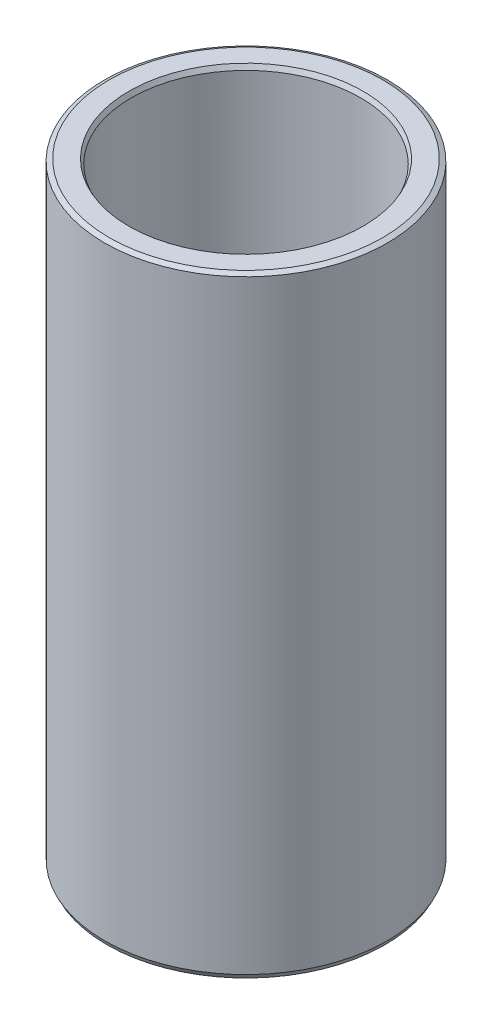
ISO-10303-21;
HEADER;
FILE_DESCRIPTION(('STEP AP214'),'2;1');
FILE_NAME('part.step','',(''),(''),'','','');
FILE_SCHEMA(('AUTOMOTIVE_DESIGN { 1 0 10303 214 1 1 1 1 }'));
ENDSEC;
DATA;
#1=APPLICATION_CONTEXT('core data for automotive mechanical design processes');
#2=APPLICATION_PROTOCOL_DEFINITION('international standard','automotive_design',2000,#1);
#3=PRODUCT_CONTEXT('',#1,'mechanical');
#4=PRODUCT('Part','Part','',(#3));
#5=PRODUCT_RELATED_PRODUCT_CATEGORY('part','',(#4));
#6=PRODUCT_DEFINITION_FORMATION('','',#4);
#7=PRODUCT_DEFINITION_CONTEXT('part definition',#1,'design');
#8=PRODUCT_DEFINITION('design','',#6,#7);
#9=PRODUCT_DEFINITION_SHAPE('','',#8);
#10=(LENGTH_UNIT() NAMED_UNIT(*) SI_UNIT(.MILLI.,.METRE.));
#11=(NAMED_UNIT(*) PLANE_ANGLE_UNIT() SI_UNIT($,.RADIAN.));
#12=(NAMED_UNIT(*) SI_UNIT($,.STERADIAN.) SOLID_ANGLE_UNIT());
#13=UNCERTAINTY_MEASURE_WITH_UNIT(LENGTH_MEASURE(1.E-05),#10,'distance_accuracy_value','');
#14=(GEOMETRIC_REPRESENTATION_CONTEXT(3) GLOBAL_UNCERTAINTY_ASSIGNED_CONTEXT((#13)) GLOBAL_UNIT_ASSIGNED_CONTEXT((#10,
#11,#12)) REPRESENTATION_CONTEXT('',''));
#15=CARTESIAN_POINT('',(0.,0.,0.));
#16=DIRECTION('',(0.,0.,1.));
#17=DIRECTION('',(1.,0.,0.));
#18=AXIS2_PLACEMENT_3D('',#15,#16,#17);
#19=CARTESIAN_POINT('',(0.,194.565541366562,0.));
#20=DIRECTION('',(0.,-1.,0.));
#21=DIRECTION('',(0.,0.,-1.));
#22=AXIS2_PLACEMENT_3D('',#19,#20,#21);
#23=CYLINDRICAL_SURFACE('',#22,45.);
#24=CARTESIAN_POINT('',(0.,1.47406431575203,0.));
#25=DIRECTION('',(0.,1.,0.));
#26=DIRECTION('',(0.,0.,1.));
#27=AXIS2_PLACEMENT_3D('',#24,#25,#26);
#28=CIRCLE('',#27,45.);
#29=CARTESIAN_POINT('',(0.,1.47406431575203,-45.));
#30=VERTEX_POINT('',#29);
#31=EDGE_CURVE('E10',#30,#30,#28,.T.);
#32=CARTESIAN_POINT('',(0.,193.831764609933,0.));
#33=DIRECTION('',(0.,1.,0.));
#34=DIRECTION('',(0.,0.,1.));
#35=AXIS2_PLACEMENT_3D('',#32,#33,#34);
#36=CIRCLE('',#35,45.);
#37=CARTESIAN_POINT('',(0.,193.831764609933,-45.));
#38=VERTEX_POINT('',#37);
#39=EDGE_CURVE('E50',#38,#38,#36,.F.);
#40=CARTESIAN_POINT('',(0.,1.47406431575203,-45.));
#41=CARTESIAN_POINT('',(0.,3.47779036048309,-45.));
#42=CARTESIAN_POINT('',(0.,5.48151640521414,-45.));
#43=CARTESIAN_POINT('',(0.,9.48896849467624,-45.));
#44=CARTESIAN_POINT('',(0.,11.4926945394073,-45.));
#45=CARTESIAN_POINT('',(0.,15.5001466288694,-45.));
#46=CARTESIAN_POINT('',(0.,17.5038726736004,-45.));
#47=CARTESIAN_POINT('',(0.,21.5113247630626,-45.));
#48=CARTESIAN_POINT('',(0.,23.5150508077936,-45.));
#49=CARTESIAN_POINT('',(0.,27.5225028972557,-45.));
#50=CARTESIAN_POINT('',(0.,29.5262289419867,-45.));
#51=CARTESIAN_POINT('',(0.,33.5336810314488,-45.));
#52=CARTESIAN_POINT('',(0.,35.5374070761799,-45.));
#53=CARTESIAN_POINT('',(0.,39.544859165642,-45.));
#54=CARTESIAN_POINT('',(0.,41.5485852103731,-45.));
#55=CARTESIAN_POINT('',(0.,45.5560372998352,-45.));
#56=CARTESIAN_POINT('',(0.,47.5597633445662,-45.));
#57=CARTESIAN_POINT('',(0.,51.5672154340283,-45.));
#58=CARTESIAN_POINT('',(0.,53.5709414787594,-45.));
#59=CARTESIAN_POINT('',(0.,57.5783935682215,-45.));
#60=CARTESIAN_POINT('',(0.,59.5821196129525,-45.));
#61=CARTESIAN_POINT('',(0.,63.5895717024146,-45.));
#62=CARTESIAN_POINT('',(0.,65.5932977471457,-45.));
#63=CARTESIAN_POINT('',(0.,69.6007498366078,-45.));
#64=CARTESIAN_POINT('',(0.,71.6044758813388,-45.));
#65=CARTESIAN_POINT('',(0.,75.6119279708009,-45.));
#66=CARTESIAN_POINT('',(0.,77.615654015532,-45.));
#67=CARTESIAN_POINT('',(0.,81.6231061049941,-45.));
#68=CARTESIAN_POINT('',(0.,83.6268321497251,-45.));
#69=CARTESIAN_POINT('',(0.,87.6342842391872,-45.));
#70=CARTESIAN_POINT('',(0.,89.6380102839183,-45.));
#71=CARTESIAN_POINT('',(0.,93.6454623733804,-45.));
#72=CARTESIAN_POINT('',(0.,95.6491884181115,-45.));
#73=CARTESIAN_POINT('',(0.,99.6566405075735,-45.));
#74=CARTESIAN_POINT('',(0.,101.660366552305,-45.));
#75=CARTESIAN_POINT('',(0.,105.667818641767,-45.));
#76=CARTESIAN_POINT('',(0.,107.671544686498,-45.));
#77=CARTESIAN_POINT('',(0.,111.67899677596,-45.));
#78=CARTESIAN_POINT('',(0.,113.682722820691,-45.));
#79=CARTESIAN_POINT('',(0.,117.690174910153,-45.));
#80=CARTESIAN_POINT('',(0.,119.693900954884,-45.));
#81=CARTESIAN_POINT('',(0.,123.701353044346,-45.));
#82=CARTESIAN_POINT('',(0.,125.705079089077,-45.));
#83=CARTESIAN_POINT('',(0.,129.712531178539,-45.));
#84=CARTESIAN_POINT('',(0.,131.71625722327,-45.));
#85=CARTESIAN_POINT('',(0.,135.723709312732,-45.));
#86=CARTESIAN_POINT('',(0.,137.727435357464,-45.));
#87=CARTESIAN_POINT('',(0.,141.734887446926,-45.));
#88=CARTESIAN_POINT('',(0.,143.738613491657,-45.));
#89=CARTESIAN_POINT('',(0.,147.746065581119,-45.));
#90=CARTESIAN_POINT('',(0.,149.74979162585,-45.));
#91=CARTESIAN_POINT('',(0.,153.757243715312,-45.));
#92=CARTESIAN_POINT('',(0.,155.760969760043,-45.));
#93=CARTESIAN_POINT('',(0.,159.768421849505,-45.));
#94=CARTESIAN_POINT('',(0.,161.772147894236,-45.));
#95=CARTESIAN_POINT('',(0.,165.779599983698,-45.));
#96=CARTESIAN_POINT('',(0.,167.783326028429,-45.));
#97=CARTESIAN_POINT('',(0.,171.790778117891,-45.));
#98=CARTESIAN_POINT('',(0.,173.794504162622,-45.));
#99=CARTESIAN_POINT('',(0.,177.801956252085,-45.));
#100=CARTESIAN_POINT('',(0.,179.805682296816,-45.));
#101=CARTESIAN_POINT('',(0.,183.813134386278,-45.));
#102=CARTESIAN_POINT('',(0.,185.816860431009,-45.));
#103=CARTESIAN_POINT('',(0.,189.824312520471,-45.));
#104=CARTESIAN_POINT('',(0.,191.828038565202,-45.));
#105=CARTESIAN_POINT('',(0.,193.831764609933,-45.));
#106=B_SPLINE_CURVE_WITH_KNOTS('',3,(#40,#41,#42,#43,#44,#45,#46,#47,#48,#49,#50,#51,#52,#53,
#54,#55,#56,#57,#58,#59,#60,#61,#62,#63,#64,#65,#66,#67,#68,#69,#70,#71,#72,#73,#74,#75,#76,#77,
#78,#79,#80,#81,#82,#83,#84,#85,#86,#87,#88,#89,#90,#91,#92,#93,#94,#95,#96,#97,#98,#99,#100,
#101,#102,#103,#104,#105),.UNSPECIFIED.,.F.,.F.,(4,2,2,2,2,2,2,2,2,2,2,2,2,2,2,2,2,2,2,2,2,2,2,
2,2,2,2,2,2,2,2,2,4),(0.,6.01117813419316,12.0223562683863,18.0335344025795,24.0447125367726,
30.0558906709658,36.0670688051589,42.0782469393521,48.0894250735452,54.1006032077384,
60.1117813419315,66.1229594761247,72.1341376103178,78.145315744511,84.1564938787042,
90.1676720128973,96.1788501470905,102.190028281284,108.201206415477,114.21238454967,
120.223562683863,126.234740818056,132.245918952249,138.257097086443,144.268275220636,
150.279453354829,156.290631489022,162.301809623215,168.312987757408,174.324165891601,
180.335344025795,186.346522159988,192.357700294181),.UNSPECIFIED.);
#107=EDGE_CURVE('BSEAM39',#30,#38,#106,.T.);
#108=ORIENTED_EDGE('',*,*,#31,.T.);
#109=ORIENTED_EDGE('',*,*,#39,.T.);
#110=ORIENTED_EDGE('',*,*,#107,.T.);
#111=ORIENTED_EDGE('',*,*,#107,.F.);
#112=EDGE_LOOP('',(#108,#110,#109,#111));
#113=FACE_BOUND('',#112,.T.);
#114=ADVANCED_FACE('F39',(#113),#23,.T.);
#115=CARTESIAN_POINT('',(0.,194.565541366562,0.));
#116=DIRECTION('',(0.,1.,0.));
#117=DIRECTION('',(0.,0.,1.));
#118=AXIS2_PLACEMENT_3D('',#115,#116,#117);
#119=PLANE('',#118);
#120=CARTESIAN_POINT('',(0.,194.565541366562,0.));
#121=DIRECTION('',(0.,1.,0.));
#122=DIRECTION('',(0.,0.,1.));
#123=AXIS2_PLACEMENT_3D('',#120,#121,#122);
#124=CIRCLE('',#123,37.2631580839012);
#125=CARTESIAN_POINT('',(0.,194.565541366562,37.2631580839012));
#126=VERTEX_POINT('',#125);
#127=EDGE_CURVE('E58',#126,#126,#124,.F.);
#128=ORIENTED_EDGE('',*,*,#127,.T.);
#129=EDGE_LOOP('',(#128));
#130=FACE_BOUND('',#129,.T.);
#131=CARTESIAN_POINT('',(0.,194.565541366562,0.));
#132=DIRECTION('',(0.,1.,0.));
#133=DIRECTION('',(0.,0.,1.));
#134=AXIS2_PLACEMENT_3D('',#131,#132,#133);
#135=CIRCLE('',#134,43.525935684248);
#136=CARTESIAN_POINT('',(0.,194.565541366562,-43.525935684248));
#137=VERTEX_POINT('',#136);
#138=EDGE_CURVE('E61',#137,#137,#135,.T.);
#139=ORIENTED_EDGE('',*,*,#138,.T.);
#140=EDGE_LOOP('',(#139));
#141=FACE_BOUND('',#140,.T.);
#142=ADVANCED_FACE('F88',(#130,#141),#119,.T.);
#143=CARTESIAN_POINT('',(0.,0.,0.));
#144=DIRECTION('',(0.,1.,0.));
#145=DIRECTION('',(0.,0.,1.));
#146=AXIS2_PLACEMENT_3D('',#143,#144,#145);
#147=PLANE('',#146);
#148=CARTESIAN_POINT('',(0.,0.,0.));
#149=DIRECTION('',(0.,1.,0.));
#150=DIRECTION('',(0.,0.,1.));
#151=AXIS2_PLACEMENT_3D('',#148,#149,#150);
#152=CIRCLE('',#151,38.003445643024);
#153=CARTESIAN_POINT('',(0.,0.,-38.003445643024));
#154=VERTEX_POINT('',#153);
#155=EDGE_CURVE('E51',#154,#154,#152,.T.);
#156=ORIENTED_EDGE('',*,*,#155,.T.);
#157=EDGE_LOOP('',(#156));
#158=FACE_BOUND('',#157,.T.);
#159=CARTESIAN_POINT('',(0.,0.,0.));
#160=DIRECTION('',(0.,1.,0.));
#161=DIRECTION('',(0.,0.,1.));
#162=AXIS2_PLACEMENT_3D('',#159,#160,#161);
#163=CIRCLE('',#162,44.2662232433708);
#164=CARTESIAN_POINT('',(0.,0.,44.2662232433708));
#165=VERTEX_POINT('',#164);
#166=EDGE_CURVE('E54',#165,#165,#163,.F.);
#167=ORIENTED_EDGE('',*,*,#166,.T.);
#168=EDGE_LOOP('',(#167));
#169=FACE_BOUND('',#168,.T.);
#170=ADVANCED_FACE('F83',(#158,#169),#147,.F.);
#171=CARTESIAN_POINT('',(0.,194.565541366562,0.));
#172=DIRECTION('',(0.,-1.,0.));
#173=DIRECTION('',(0.,0.,-1.));
#174=AXIS2_PLACEMENT_3D('',#171,#172,#173);
#175=CYLINDRICAL_SURFACE('',#174,36.529381327272);
#176=CARTESIAN_POINT('',(0.,193.09147705081,0.));
#177=DIRECTION('',(0.,1.,0.));
#178=DIRECTION('',(0.,0.,1.));
#179=AXIS2_PLACEMENT_3D('',#176,#177,#178);
#180=CIRCLE('',#179,36.529381327272);
#181=CARTESIAN_POINT('',(0.,193.09147705081,36.529381327272));
#182=VERTEX_POINT('',#181);
#183=EDGE_CURVE('E67',#182,#182,#180,.T.);
#184=ORIENTED_EDGE('',*,*,#183,.T.);
#185=EDGE_LOOP('',(#184));
#186=FACE_BOUND('',#185,.T.);
#187=CARTESIAN_POINT('',(0.,0.733776756629223,0.));
#188=DIRECTION('',(0.,1.,0.));
#189=DIRECTION('',(0.,0.,1.));
#190=AXIS2_PLACEMENT_3D('',#187,#188,#189);
#191=CIRCLE('',#190,36.529381327272);
#192=CARTESIAN_POINT('',(0.,0.733776756629223,-36.529381327272));
#193=VERTEX_POINT('',#192);
#194=EDGE_CURVE('E69',#193,#193,#191,.F.);
#195=ORIENTED_EDGE('',*,*,#194,.T.);
#196=EDGE_LOOP('',(#195));
#197=FACE_BOUND('',#196,.T.);
#198=ADVANCED_FACE('F71',(#186,#197),#175,.F.);
#199=CARTESIAN_POINT('',(0.,193.09147705081,0.));
#200=DIRECTION('',(0.,1.,0.));
#201=DIRECTION('',(0.,0.,1.));
#202=AXIS2_PLACEMENT_3D('',#199,#200,#201);
#203=CONICAL_SURFACE('',#202,36.529381327272,0.461879286618544);
#204=ORIENTED_EDGE('',*,*,#127,.F.);
#205=EDGE_LOOP('',(#204));
#206=FACE_BOUND('',#205,.T.);
#207=ORIENTED_EDGE('',*,*,#183,.F.);
#208=EDGE_LOOP('',(#207));
#209=FACE_BOUND('',#208,.T.);
#210=ADVANCED_FACE('F77',(#206,#209),#203,.F.);
#211=CARTESIAN_POINT('',(0.,0.,0.));
#212=DIRECTION('',(0.,-1.,0.));
#213=DIRECTION('',(0.,0.,-1.));
#214=AXIS2_PLACEMENT_3D('',#211,#212,#213);
#215=CONICAL_SURFACE('',#214,38.003445643024,1.10891704017636);
#216=CARTESIAN_POINT('',(0.,0.733776756629223,-36.529381327272));
#217=CARTESIAN_POINT('',(0.,0.726133248747668,-36.5447361638944));
#218=CARTESIAN_POINT('',(0.,0.718489740866114,-36.5600910005168));
#219=CARTESIAN_POINT('',(0.,0.703202725103005,-36.5908006737616));
#220=CARTESIAN_POINT('',(0.,0.695559217221451,-36.6061555103841));
#221=CARTESIAN_POINT('',(0.,0.680272201458342,-36.6368651836289));
#222=CARTESIAN_POINT('',(0.,0.672628693576788,-36.6522200202513));
#223=CARTESIAN_POINT('',(0.,0.657341677813679,-36.6829296934961));
#224=CARTESIAN_POINT('',(0.,0.649698169932124,-36.6982845301186));
#225=CARTESIAN_POINT('',(0.,0.634411154169016,-36.7289942033634));
#226=CARTESIAN_POINT('',(0.,0.626767646287461,-36.7443490399858));
#227=CARTESIAN_POINT('',(0.,0.611480630524352,-36.7750587132306));
#228=CARTESIAN_POINT('',(0.,0.603837122642798,-36.7904135498531));
#229=CARTESIAN_POINT('',(0.,0.588550106879689,-36.8211232230979));
#230=CARTESIAN_POINT('',(0.,0.580906598998135,-36.8364780597203));
#231=CARTESIAN_POINT('',(0.,0.565619583235026,-36.8671877329651));
#232=CARTESIAN_POINT('',(0.,0.557976075353471,-36.8825425695876));
#233=CARTESIAN_POINT('',(0.,0.542689059590362,-36.9132522428324));
#234=CARTESIAN_POINT('',(0.,0.535045551708809,-36.9286070794548));
#235=CARTESIAN_POINT('',(0.,0.5197585359457,-36.9593167526997));
#236=CARTESIAN_POINT('',(0.,0.512115028064145,-36.9746715893221));
#237=CARTESIAN_POINT('',(0.,0.496828012301036,-37.0053812625669));
#238=CARTESIAN_POINT('',(0.,0.489184504419482,-37.0207360991893));
#239=CARTESIAN_POINT('',(0.,0.473897488656373,-37.0514457724342));
#240=CARTESIAN_POINT('',(0.,0.466253980774819,-37.0668006090566));
#241=CARTESIAN_POINT('',(0.,0.45096696501171,-37.0975102823014));
#242=CARTESIAN_POINT('',(0.,0.443323457130156,-37.1128651189238));
#243=CARTESIAN_POINT('',(0.,0.428036441367047,-37.1435747921687));
#244=CARTESIAN_POINT('',(0.,0.420392933485492,-37.1589296287911));
#245=CARTESIAN_POINT('',(0.,0.405105917722384,-37.1896393020359));
#246=CARTESIAN_POINT('',(0.,0.397462409840829,-37.2049941386583));
#247=CARTESIAN_POINT('',(0.,0.38217539407772,-37.2357038119032));
#248=CARTESIAN_POINT('',(0.,0.374531886196166,-37.2510586485256));
#249=CARTESIAN_POINT('',(0.,0.359244870433057,-37.2817683217704));
#250=CARTESIAN_POINT('',(0.,0.351601362551503,-37.2971231583928));
#251=CARTESIAN_POINT('',(0.,0.336314346788394,-37.3278328316377));
#252=CARTESIAN_POINT('',(0.,0.328670838906839,-37.3431876682601));
#253=CARTESIAN_POINT('',(0.,0.313383823143731,-37.3738973415049));
#254=CARTESIAN_POINT('',(0.,0.305740315262176,-37.3892521781273));
#255=CARTESIAN_POINT('',(0.,0.290453299499067,-37.4199618513722));
#256=CARTESIAN_POINT('',(0.,0.282809791617513,-37.4353166879946));
#257=CARTESIAN_POINT('',(0.,0.267522775854404,-37.4660263612394));
#258=CARTESIAN_POINT('',(0.,0.25987926797285,-37.4813811978618));
#259=CARTESIAN_POINT('',(0.,0.244592252209741,-37.5120908711067));
#260=CARTESIAN_POINT('',(0.,0.236948744328187,-37.5274457077291));
#261=CARTESIAN_POINT('',(0.,0.221661728565078,-37.5581553809739));
#262=CARTESIAN_POINT('',(0.,0.214018220683523,-37.5735102175963));
#263=CARTESIAN_POINT('',(0.,0.198731204920414,-37.6042198908412));
#264=CARTESIAN_POINT('',(0.,0.19108769703886,-37.6195747274636));
#265=CARTESIAN_POINT('',(0.,0.175800681275752,-37.6502844007084));
#266=CARTESIAN_POINT('',(0.,0.168157173394197,-37.6656392373308));
#267=CARTESIAN_POINT('',(0.,0.152870157631088,-37.6963489105757));
#268=CARTESIAN_POINT('',(0.,0.145226649749534,-37.7117037471981));
#269=CARTESIAN_POINT('',(0.,0.129939633986425,-37.7424134204429));
#270=CARTESIAN_POINT('',(0.,0.122296126104871,-37.7577682570653));
#271=CARTESIAN_POINT('',(0.,0.107009110341762,-37.7884779303102));
#272=CARTESIAN_POINT('',(0.,0.0993656024602073,-37.8038327669326));
#273=CARTESIAN_POINT('',(0.,0.0840785866970985,-37.8345424401774));
#274=CARTESIAN_POINT('',(0.,0.0764350788155441,-37.8498972767998));
#275=CARTESIAN_POINT('',(0.,0.0611480630524352,-37.8806069500447));
#276=CARTESIAN_POINT('',(0.,0.0535045551708808,-37.8959617866671));
#277=CARTESIAN_POINT('',(0.,0.038217539407772,-37.9266714599119));
#278=CARTESIAN_POINT('',(0.,0.0305740315262176,-37.9420262965344));
#279=CARTESIAN_POINT('',(0.,0.0152870157631088,-37.9727359697792));
#280=CARTESIAN_POINT('',(0.,0.0076435078815544,-37.9880908064016));
#281=CARTESIAN_POINT('',(0.,0.,-38.003445643024));
#282=B_SPLINE_CURVE_WITH_KNOTS('',3,(#216,#217,#218,#219,#220,#221,#222,#223,#224,#225,#226,
#227,#228,#229,#230,#231,#232,#233,#234,#235,#236,#237,#238,#239,#240,#241,#242,#243,#244,#245,
#246,#247,#248,#249,#250,#251,#252,#253,#254,#255,#256,#257,#258,#259,#260,#261,#262,#263,#264,
#265,#266,#267,#268,#269,#270,#271,#272,#273,#274,#275,#276,#277,#278,#279,#280,#281),
.UNSPECIFIED.,.F.,.F.,(4,2,2,2,2,2,2,2,2,2,2,2,2,2,2,2,2,2,2,2,2,2,2,2,2,2,2,2,2,2,2,2,4),(0.,
0.0514562725421161,0.102912545084232,0.154368817626348,0.205825090168464,0.25728136271058,
0.308737635252696,0.360193907794812,0.411650180336928,0.463106452879051,0.514562725421167,
0.566018997963283,0.617475270505399,0.668931543047515,0.720387815589631,0.771844088131747,
0.823300360673863,0.874756633215979,0.926212905758095,0.977669178300211,1.02912545084233,
1.08058172338444,1.13203799592656,1.18349426846868,1.2349505410108,1.28640681355291,
1.33786308609503,1.38931935863715,1.44077563117926,1.49223190372138,1.54368817626349,
1.59514444880561,1.64660072134773),.UNSPECIFIED.);
#283=EDGE_CURVE('BSEAM73',#193,#154,#282,.T.);
#284=ORIENTED_EDGE('',*,*,#194,.F.);
#285=ORIENTED_EDGE('',*,*,#155,.F.);
#286=ORIENTED_EDGE('',*,*,#283,.T.);
#287=ORIENTED_EDGE('',*,*,#283,.F.);
#288=EDGE_LOOP('',(#284,#286,#285,#287));
#289=FACE_BOUND('',#288,.T.);
#290=ADVANCED_FACE('F73',(#289),#215,.F.);
#291=CARTESIAN_POINT('',(0.,1.47406431575203,0.));
#292=DIRECTION('',(0.,1.,0.));
#293=DIRECTION('',(0.,0.,1.));
#294=AXIS2_PLACEMENT_3D('',#291,#292,#293);
#295=CONICAL_SURFACE('',#294,45.,0.461879286618525);
#296=ORIENTED_EDGE('',*,*,#166,.F.);
#297=EDGE_LOOP('',(#296));
#298=FACE_BOUND('',#297,.T.);
#299=ORIENTED_EDGE('',*,*,#31,.F.);
#300=EDGE_LOOP('',(#299));
#301=FACE_BOUND('',#300,.T.);
#302=ADVANCED_FACE('F76',(#298,#301),#295,.T.);
#303=CARTESIAN_POINT('',(0.,194.565541366562,0.));
#304=DIRECTION('',(0.,-1.,0.));
#305=DIRECTION('',(0.,0.,-1.));
#306=AXIS2_PLACEMENT_3D('',#303,#304,#305);
#307=CONICAL_SURFACE('',#306,43.525935684248,1.10891704017636);
#308=CARTESIAN_POINT('',(0.,193.831764609933,-45.));
#309=CARTESIAN_POINT('',(0.,193.839408117814,-44.9846451633776));
#310=CARTESIAN_POINT('',(0.,193.847051625696,-44.9692903267552));
#311=CARTESIAN_POINT('',(0.,193.862338641459,-44.9385806535104));
#312=CARTESIAN_POINT('',(0.,193.869982149341,-44.9232258168879));
#313=CARTESIAN_POINT('',(0.,193.885269165104,-44.8925161436431));
#314=CARTESIAN_POINT('',(0.,193.892912672985,-44.8771613070207));
#315=CARTESIAN_POINT('',(0.,193.908199688748,-44.8464516337759));
#316=CARTESIAN_POINT('',(0.,193.91584319663,-44.8310967971534));
#317=CARTESIAN_POINT('',(0.,193.931130212393,-44.8003871239086));
#318=CARTESIAN_POINT('',(0.,193.938773720275,-44.7850322872862));
#319=CARTESIAN_POINT('',(0.,193.954060736038,-44.7543226140414));
#320=CARTESIAN_POINT('',(0.,193.961704243919,-44.7389677774189));
#321=CARTESIAN_POINT('',(0.,193.976991259682,-44.7082581041741));
#322=CARTESIAN_POINT('',(0.,193.984634767564,-44.6929032675517));
#323=CARTESIAN_POINT('',(0.,193.999921783327,-44.6621935943069));
#324=CARTESIAN_POINT('',(0.,194.007565291209,-44.6468387576844));
#325=CARTESIAN_POINT('',(0.,194.022852306972,-44.6161290844396));
#326=CARTESIAN_POINT('',(0.,194.030495814853,-44.6007742478172));
#327=CARTESIAN_POINT('',(0.,194.045782830617,-44.5700645745724));
#328=CARTESIAN_POINT('',(0.,194.053426338498,-44.5547097379499));
#329=CARTESIAN_POINT('',(0.,194.068713354261,-44.5240000647051));
#330=CARTESIAN_POINT('',(0.,194.076356862143,-44.5086452280827));
#331=CARTESIAN_POINT('',(0.,194.091643877906,-44.4779355548378));
#332=CARTESIAN_POINT('',(0.,194.099287385787,-44.4625807182154));
#333=CARTESIAN_POINT('',(0.,194.11457440155,-44.4318710449706));
#334=CARTESIAN_POINT('',(0.,194.122217909432,-44.4165162083482));
#335=CARTESIAN_POINT('',(0.,194.137504925195,-44.3858065351033));
#336=CARTESIAN_POINT('',(0.,194.145148433077,-44.3704516984809));
#337=CARTESIAN_POINT('',(0.,194.16043544884,-44.3397420252361));
#338=CARTESIAN_POINT('',(0.,194.168078956721,-44.3243871886137));
#339=CARTESIAN_POINT('',(0.,194.183365972484,-44.2936775153689));
#340=CARTESIAN_POINT('',(0.,194.191009480366,-44.2783226787464));
#341=CARTESIAN_POINT('',(0.,194.206296496129,-44.2476130055016));
#342=CARTESIAN_POINT('',(0.,194.213940004011,-44.2322581688792));
#343=CARTESIAN_POINT('',(0.,194.229227019774,-44.2015484956344));
#344=CARTESIAN_POINT('',(0.,194.236870527655,-44.1861936590119));
#345=CARTESIAN_POINT('',(0.,194.252157543418,-44.1554839857671));
#346=CARTESIAN_POINT('',(0.,194.2598010513,-44.1401291491447));
#347=CARTESIAN_POINT('',(0.,194.275088067063,-44.1094194758998));
#348=CARTESIAN_POINT('',(0.,194.282731574945,-44.0940646392774));
#349=CARTESIAN_POINT('',(0.,194.298018590708,-44.0633549660326));
#350=CARTESIAN_POINT('',(0.,194.305662098589,-44.0480001294102));
#351=CARTESIAN_POINT('',(0.,194.320949114352,-44.0172904561653));
#352=CARTESIAN_POINT('',(0.,194.328592622234,-44.0019356195429));
#353=CARTESIAN_POINT('',(0.,194.343879637997,-43.9712259462981));
#354=CARTESIAN_POINT('',(0.,194.351523145879,-43.9558711096757));
#355=CARTESIAN_POINT('',(0.,194.366810161642,-43.9251614364308));
#356=CARTESIAN_POINT('',(0.,194.374453669523,-43.9098065998084));
#357=CARTESIAN_POINT('',(0.,194.389740685286,-43.8790969265636));
#358=CARTESIAN_POINT('',(0.,194.397384193168,-43.8637420899412));
#359=CARTESIAN_POINT('',(0.,194.412671208931,-43.8330324166963));
#360=CARTESIAN_POINT('',(0.,194.420314716813,-43.8176775800739));
#361=CARTESIAN_POINT('',(0.,194.435601732576,-43.7869679068291));
#362=CARTESIAN_POINT('',(0.,194.443245240457,-43.7716130702067));
#363=CARTESIAN_POINT('',(0.,194.45853225622,-43.7409033969618));
#364=CARTESIAN_POINT('',(0.,194.466175764102,-43.7255485603394));
#365=CARTESIAN_POINT('',(0.,194.481462779865,-43.6948388870946));
#366=CARTESIAN_POINT('',(0.,194.489106287747,-43.6794840504722));
#367=CARTESIAN_POINT('',(0.,194.50439330351,-43.6487743772273));
#368=CARTESIAN_POINT('',(0.,194.512036811391,-43.6334195406049));
#369=CARTESIAN_POINT('',(0.,194.527323827154,-43.6027098673601));
#370=CARTESIAN_POINT('',(0.,194.534967335036,-43.5873550307377));
#371=CARTESIAN_POINT('',(0.,194.550254350799,-43.5566453574928));
#372=CARTESIAN_POINT('',(0.,194.557897858681,-43.5412905208704));
#373=CARTESIAN_POINT('',(0.,194.565541366562,-43.525935684248));
#374=B_SPLINE_CURVE_WITH_KNOTS('',3,(#308,#309,#310,#311,#312,#313,#314,#315,#316,#317,#318,
#319,#320,#321,#322,#323,#324,#325,#326,#327,#328,#329,#330,#331,#332,#333,#334,#335,#336,#337,
#338,#339,#340,#341,#342,#343,#344,#345,#346,#347,#348,#349,#350,#351,#352,#353,#354,#355,#356,
#357,#358,#359,#360,#361,#362,#363,#364,#365,#366,#367,#368,#369,#370,#371,#372,#373),
.UNSPECIFIED.,.F.,.F.,(4,2,2,2,2,2,2,2,2,2,2,2,2,2,2,2,2,2,2,2,2,2,2,2,2,2,2,2,2,2,2,2,4),(0.,
0.0514562725421269,0.102912545084241,0.154368817626356,0.20582509016847,0.257281362710585,
0.308737635252699,0.360193907794814,0.411650180336928,0.463106452879055,0.51456272542117,
0.566018997963284,0.617475270505399,0.668931543047513,0.720387815589628,0.771844088131742,
0.82330036067385,0.874756633215977,0.926212905758092,0.977669178300206,1.02912545084232,
1.08058172338444,1.13203799592655,1.18349426846866,1.23495054101079,1.28640681355291,
1.33786308609502,1.38931935863714,1.44077563117925,1.49223190372136,1.54368817626348,
1.59514444880559,1.64660072134772),.UNSPECIFIED.);
#375=EDGE_CURVE('BSEAM45',#38,#137,#374,.T.);
#376=ORIENTED_EDGE('',*,*,#39,.F.);
#377=ORIENTED_EDGE('',*,*,#138,.F.);
#378=ORIENTED_EDGE('',*,*,#375,.T.);
#379=ORIENTED_EDGE('',*,*,#375,.F.);
#380=EDGE_LOOP('',(#376,#378,#377,#379));
#381=FACE_BOUND('',#380,.T.);
#382=ADVANCED_FACE('F45',(#381),#307,.T.);
#383=CLOSED_SHELL('',(#114,#142,#170,#198,#210,#290,#302,#382));
#384=MANIFOLD_SOLID_BREP('B2',#383);
#385=ADVANCED_BREP_SHAPE_REPRESENTATION('',(#18,#384),#14);
#386=SHAPE_DEFINITION_REPRESENTATION(#9,#385);
ENDSEC;
END-ISO-10303-21;
